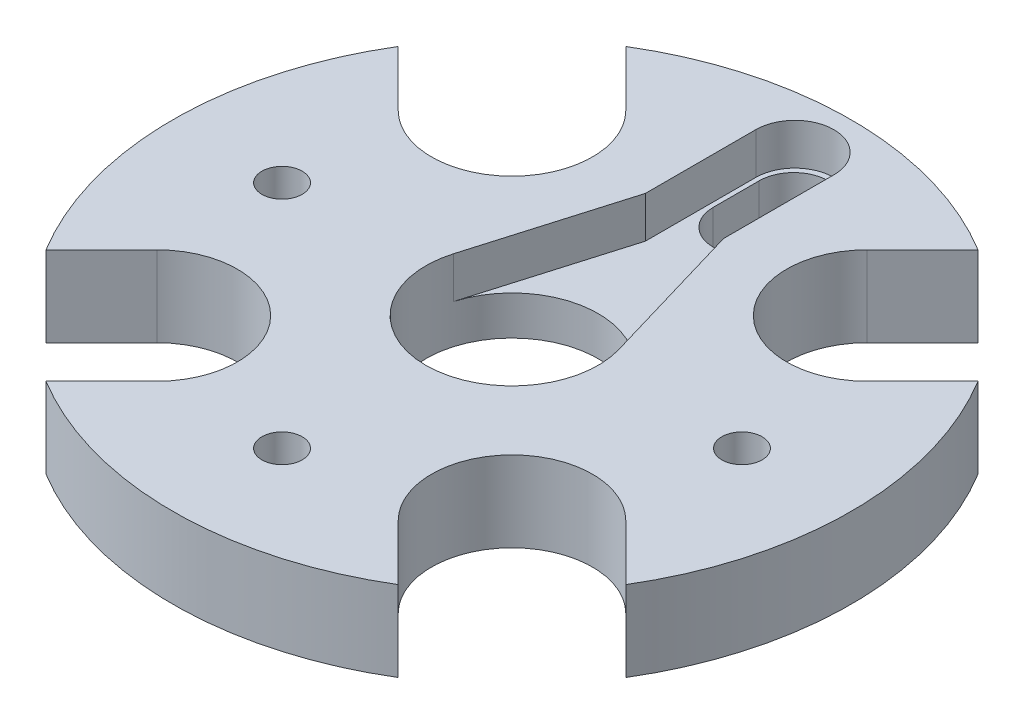
ISO-10303-21;
HEADER;
FILE_DESCRIPTION(('STEP AP214'),'2;1');
FILE_NAME('part.step','',(''),(''),'','','');
FILE_SCHEMA(('AUTOMOTIVE_DESIGN { 1 0 10303 214 1 1 1 1 }'));
ENDSEC;
DATA;
#1=APPLICATION_CONTEXT('core data for automotive mechanical design processes');
#2=APPLICATION_PROTOCOL_DEFINITION('international standard','automotive_design',2000,#1);
#3=PRODUCT_CONTEXT('',#1,'mechanical');
#4=PRODUCT('Part','Part','',(#3));
#5=PRODUCT_RELATED_PRODUCT_CATEGORY('part','',(#4));
#6=PRODUCT_DEFINITION_FORMATION('','',#4);
#7=PRODUCT_DEFINITION_CONTEXT('part definition',#1,'design');
#8=PRODUCT_DEFINITION('design','',#6,#7);
#9=PRODUCT_DEFINITION_SHAPE('','',#8);
#10=(LENGTH_UNIT() NAMED_UNIT(*) SI_UNIT(.MILLI.,.METRE.));
#11=(NAMED_UNIT(*) PLANE_ANGLE_UNIT() SI_UNIT($,.RADIAN.));
#12=(NAMED_UNIT(*) SI_UNIT($,.STERADIAN.) SOLID_ANGLE_UNIT());
#13=UNCERTAINTY_MEASURE_WITH_UNIT(LENGTH_MEASURE(1.E-05),#10,'distance_accuracy_value','');
#14=(GEOMETRIC_REPRESENTATION_CONTEXT(3) GLOBAL_UNCERTAINTY_ASSIGNED_CONTEXT((#13)) GLOBAL_UNIT_ASSIGNED_CONTEXT((#10,
#11,#12)) REPRESENTATION_CONTEXT('',''));
#15=CARTESIAN_POINT('',(0.,0.,0.));
#16=DIRECTION('',(0.,0.,1.));
#17=DIRECTION('',(1.,0.,0.));
#18=AXIS2_PLACEMENT_3D('',#15,#16,#17);
#19=CARTESIAN_POINT('',(20.0000000000001,-2.9999999999999,1.1696199564426E-12));
#20=DIRECTION('',(0.,1.,0.));
#21=DIRECTION('',(0.,0.,1.));
#22=AXIS2_PLACEMENT_3D('',#19,#20,#21);
#23=CYLINDRICAL_SURFACE('',#22,1.74999999999924);
#24=CARTESIAN_POINT('',(20.0000000000001,7.,1.16767706614951E-12));
#25=DIRECTION('',(0.,1.,0.));
#26=DIRECTION('',(0.,0.,1.));
#27=AXIS2_PLACEMENT_3D('',#24,#25,#26);
#28=CIRCLE('',#27,1.74999999999924);
#29=CARTESIAN_POINT('',(20.0000000000001,7.,1.75000000000041));
#30=VERTEX_POINT('',#29);
#31=EDGE_CURVE('E255',#30,#30,#28,.T.);
#32=ORIENTED_EDGE('',*,*,#31,.T.);
#33=EDGE_LOOP('',(#32));
#34=FACE_BOUND('',#33,.T.);
#35=CARTESIAN_POINT('',(20.0000000000001,2.4,1.16857079568433E-12));
#36=DIRECTION('',(0.,-1.,0.));
#37=DIRECTION('',(0.,0.,-1.));
#38=AXIS2_PLACEMENT_3D('',#35,#36,#37);
#39=CIRCLE('',#38,1.74999999999924);
#40=CARTESIAN_POINT('',(20.0000000000001,2.4,-1.74999999999808));
#41=VERTEX_POINT('',#40);
#42=EDGE_CURVE('E38',#41,#41,#39,.F.);
#43=ORIENTED_EDGE('',*,*,#42,.F.);
#44=EDGE_LOOP('',(#43));
#45=FACE_BOUND('',#44,.T.);
#46=ADVANCED_FACE('F34',(#34,#45),#23,.F.);
#47=CARTESIAN_POINT('',(-20.0000000000004,-2.9999999999999,1.9817480989559E-13));
#48=DIRECTION('',(0.,1.,0.));
#49=DIRECTION('',(0.,0.,1.));
#50=AXIS2_PLACEMENT_3D('',#47,#48,#49);
#51=CYLINDRICAL_SURFACE('',#50,1.7499999999993);
#52=CARTESIAN_POINT('',(-20.0000000000004,7.,1.96231919602496E-13));
#53=DIRECTION('',(0.,1.,0.));
#54=DIRECTION('',(0.,0.,1.));
#55=AXIS2_PLACEMENT_3D('',#52,#53,#54);
#56=CIRCLE('',#55,1.7499999999993);
#57=CARTESIAN_POINT('',(-20.0000000000004,7.,1.74999999999949));
#58=VERTEX_POINT('',#57);
#59=EDGE_CURVE('E417',#58,#58,#56,.T.);
#60=ORIENTED_EDGE('',*,*,#59,.T.);
#61=EDGE_LOOP('',(#60));
#62=FACE_BOUND('',#61,.T.);
#63=CARTESIAN_POINT('',(-20.0000000000004,2.4,1.9712564913732E-13));
#64=DIRECTION('',(0.,-1.,0.));
#65=DIRECTION('',(0.,0.,-1.));
#66=AXIS2_PLACEMENT_3D('',#63,#64,#65);
#67=CIRCLE('',#66,1.7499999999993);
#68=CARTESIAN_POINT('',(-20.0000000000004,2.4,-1.7499999999991));
#69=VERTEX_POINT('',#68);
#70=EDGE_CURVE('E419',#69,#69,#67,.F.);
#71=ORIENTED_EDGE('',*,*,#70,.F.);
#72=EDGE_LOOP('',(#71));
#73=FACE_BOUND('',#72,.T.);
#74=ADVANCED_FACE('F470',(#62,#73),#51,.F.);
#75=CARTESIAN_POINT('',(-6.79456491070596E-13,-2.99999999999989,20.000000000001));
#76=DIRECTION('',(0.,1.,0.));
#77=DIRECTION('',(0.,0.,1.));
#78=AXIS2_PLACEMENT_3D('',#75,#76,#77);
#79=CYLINDRICAL_SURFACE('',#78,1.74999999999918);
#80=CARTESIAN_POINT('',(-6.79734046826752E-13,7.,20.000000000001));
#81=DIRECTION('',(0.,1.,0.));
#82=DIRECTION('',(0.,0.,1.));
#83=AXIS2_PLACEMENT_3D('',#80,#81,#82);
#84=CIRCLE('',#83,1.74999999999918);
#85=CARTESIAN_POINT('',(-6.79734046826752E-13,7.,21.7500000000002));
#86=VERTEX_POINT('',#85);
#87=EDGE_CURVE('E446',#86,#86,#84,.T.);
#88=ORIENTED_EDGE('',*,*,#87,.T.);
#89=EDGE_LOOP('',(#88));
#90=FACE_BOUND('',#89,.T.);
#91=CARTESIAN_POINT('',(-6.7960637117892E-13,2.4,20.000000000001));
#92=DIRECTION('',(0.,-1.,0.));
#93=DIRECTION('',(0.,0.,-1.));
#94=AXIS2_PLACEMENT_3D('',#91,#92,#93);
#95=CIRCLE('',#94,1.74999999999918);
#96=CARTESIAN_POINT('',(-6.7960637117892E-13,2.4,18.2500000000018));
#97=VERTEX_POINT('',#96);
#98=EDGE_CURVE('E415',#97,#97,#95,.F.);
#99=ORIENTED_EDGE('',*,*,#98,.F.);
#100=EDGE_LOOP('',(#99));
#101=FACE_BOUND('',#100,.T.);
#102=ADVANCED_FACE('F475',(#90,#101),#79,.F.);
#103=CARTESIAN_POINT('',(0.,7.,0.));
#104=DIRECTION('',(0.,-1.,0.));
#105=DIRECTION('',(0.,0.,-1.));
#106=AXIS2_PLACEMENT_3D('',#103,#104,#105);
#107=CYLINDRICAL_SURFACE('',#106,29.5);
#108=CARTESIAN_POINT('',(0.,7.,0.));
#109=DIRECTION('',(0.,1.,0.));
#110=DIRECTION('',(0.,0.,1.));
#111=AXIS2_PLACEMENT_3D('',#108,#109,#110);
#112=CIRCLE('',#111,29.5);
#113=CARTESIAN_POINT('',(25.2136315974653,7.,15.3141366608536));
#114=VERTEX_POINT('',#113);
#115=CARTESIAN_POINT('',(25.2136315974653,7.,-15.3141366608536));
#116=VERTEX_POINT('',#115);
#117=EDGE_CURVE('E372',#114,#116,#112,.T.);
#118=ORIENTED_EDGE('',*,*,#117,.F.);
#119=DIRECTION('',(0.,-1.,0.));
#120=VECTOR('',#119,1.);
#121=CARTESIAN_POINT('',(25.2136315974653,7.,15.3141366608536));
#122=LINE('',#121,#120);
#123=CARTESIAN_POINT('',(25.2136315974653,0.,15.3141366608536));
#124=VERTEX_POINT('',#123);
#125=EDGE_CURVE('E273',#114,#124,#122,.T.);
#126=ORIENTED_EDGE('',*,*,#125,.T.);
#127=CARTESIAN_POINT('',(0.,0.,0.));
#128=DIRECTION('',(0.,1.,0.));
#129=DIRECTION('',(0.,0.,1.));
#130=AXIS2_PLACEMENT_3D('',#127,#128,#129);
#131=CIRCLE('',#130,29.5);
#132=CARTESIAN_POINT('',(25.2136315974653,0.,-15.3141366608536));
#133=VERTEX_POINT('',#132);
#134=EDGE_CURVE('E356',#124,#133,#131,.T.);
#135=ORIENTED_EDGE('',*,*,#134,.T.);
#136=DIRECTION('',(0.,-1.,0.));
#137=VECTOR('',#136,1.);
#138=CARTESIAN_POINT('',(25.2136315974653,7.,-15.3141366608536));
#139=LINE('',#138,#137);
#140=EDGE_CURVE('E288',#133,#116,#139,.F.);
#141=ORIENTED_EDGE('',*,*,#140,.T.);
#142=EDGE_LOOP('',(#118,#126,#135,#141));
#143=FACE_BOUND('',#142,.T.);
#144=ADVANCED_FACE('F465',(#143),#107,.T.);
#145=CARTESIAN_POINT('',(-15.3141366608536,0.,25.2136315974653));
#146=VERTEX_POINT('',#145);
#147=CARTESIAN_POINT('',(15.3141366608536,0.,25.2136315974653));
#148=VERTEX_POINT('',#147);
#149=EDGE_CURVE('E588',#146,#148,#131,.T.);
#150=ORIENTED_EDGE('',*,*,#149,.T.);
#151=DIRECTION('',(0.,-1.,0.));
#152=VECTOR('',#151,1.);
#153=CARTESIAN_POINT('',(15.3141366608536,7.,25.2136315974653));
#154=LINE('',#153,#152);
#155=CARTESIAN_POINT('',(15.3141366608536,7.,25.2136315974653));
#156=VERTEX_POINT('',#155);
#157=EDGE_CURVE('E51',#148,#156,#154,.F.);
#158=ORIENTED_EDGE('',*,*,#157,.T.);
#159=CARTESIAN_POINT('',(-15.3141366608536,7.,25.2136315974653));
#160=VERTEX_POINT('',#159);
#161=EDGE_CURVE('E232',#160,#156,#112,.T.);
#162=ORIENTED_EDGE('',*,*,#161,.F.);
#163=DIRECTION('',(0.,-1.,0.));
#164=VECTOR('',#163,1.);
#165=CARTESIAN_POINT('',(-15.3141366608536,7.,25.2136315974653));
#166=LINE('',#165,#164);
#167=EDGE_CURVE('E269',#160,#146,#166,.T.);
#168=ORIENTED_EDGE('',*,*,#167,.T.);
#169=EDGE_LOOP('',(#150,#158,#162,#168));
#170=FACE_BOUND('',#169,.T.);
#171=ADVANCED_FACE('F608',(#170),#107,.T.);
#172=CARTESIAN_POINT('',(-25.2136315974653,0.,-15.3141366608536));
#173=VERTEX_POINT('',#172);
#174=CARTESIAN_POINT('',(-25.2136315974653,0.,15.3141366608536));
#175=VERTEX_POINT('',#174);
#176=EDGE_CURVE('E376',#173,#175,#131,.T.);
#177=ORIENTED_EDGE('',*,*,#176,.T.);
#178=DIRECTION('',(0.,-1.,0.));
#179=VECTOR('',#178,1.);
#180=CARTESIAN_POINT('',(-25.2136315974653,7.,15.3141366608536));
#181=LINE('',#180,#179);
#182=CARTESIAN_POINT('',(-25.2136315974653,7.,15.3141366608536));
#183=VERTEX_POINT('',#182);
#184=EDGE_CURVE('E59',#175,#183,#181,.F.);
#185=ORIENTED_EDGE('',*,*,#184,.T.);
#186=CARTESIAN_POINT('',(-25.2136315974653,7.,-15.3141366608536));
#187=VERTEX_POINT('',#186);
#188=EDGE_CURVE('E371',#187,#183,#112,.T.);
#189=ORIENTED_EDGE('',*,*,#188,.F.);
#190=DIRECTION('',(0.,-1.,0.));
#191=VECTOR('',#190,1.);
#192=CARTESIAN_POINT('',(-25.2136315974653,7.,-15.3141366608536));
#193=LINE('',#192,#191);
#194=EDGE_CURVE('E265',#187,#173,#193,.T.);
#195=ORIENTED_EDGE('',*,*,#194,.T.);
#196=EDGE_LOOP('',(#177,#185,#189,#195));
#197=FACE_BOUND('',#196,.T.);
#198=ADVANCED_FACE('F463',(#197),#107,.T.);
#199=CARTESIAN_POINT('',(15.3141366608536,0.,-25.2136315974653));
#200=VERTEX_POINT('',#199);
#201=CARTESIAN_POINT('',(-15.3141366608536,0.,-25.2136315974653));
#202=VERTEX_POINT('',#201);
#203=EDGE_CURVE('E373',#200,#202,#131,.T.);
#204=ORIENTED_EDGE('',*,*,#203,.T.);
#205=DIRECTION('',(0.,-1.,0.));
#206=VECTOR('',#205,1.);
#207=CARTESIAN_POINT('',(-15.3141366608536,7.,-25.2136315974653));
#208=LINE('',#207,#206);
#209=CARTESIAN_POINT('',(-15.3141366608536,7.,-25.2136315974653));
#210=VERTEX_POINT('',#209);
#211=EDGE_CURVE('E237',#202,#210,#208,.F.);
#212=ORIENTED_EDGE('',*,*,#211,.T.);
#213=CARTESIAN_POINT('',(15.3141366608536,7.,-25.2136315974653));
#214=VERTEX_POINT('',#213);
#215=EDGE_CURVE('E367',#214,#210,#112,.T.);
#216=ORIENTED_EDGE('',*,*,#215,.F.);
#217=DIRECTION('',(0.,-1.,0.));
#218=VECTOR('',#217,1.);
#219=CARTESIAN_POINT('',(15.3141366608536,7.,-25.2136315974653));
#220=LINE('',#219,#218);
#221=EDGE_CURVE('E292',#214,#200,#220,.T.);
#222=ORIENTED_EDGE('',*,*,#221,.T.);
#223=EDGE_LOOP('',(#204,#212,#216,#222));
#224=FACE_BOUND('',#223,.T.);
#225=ADVANCED_FACE('F36',(#224),#107,.T.);
#226=CARTESIAN_POINT('',(0.,7.,0.));
#227=DIRECTION('',(0.,1.,0.));
#228=DIRECTION('',(0.,0.,1.));
#229=AXIS2_PLACEMENT_3D('',#226,#227,#228);
#230=PLANE('',#229);
#231=ORIENTED_EDGE('',*,*,#87,.F.);
#232=EDGE_LOOP('',(#231));
#233=FACE_BOUND('',#232,.T.);
#234=ORIENTED_EDGE('',*,*,#59,.F.);
#235=EDGE_LOOP('',(#234));
#236=FACE_BOUND('',#235,.T.);
#237=ORIENTED_EDGE('',*,*,#31,.F.);
#238=EDGE_LOOP('',(#237));
#239=FACE_BOUND('',#238,.T.);
#240=DIRECTION('',(-0.707106781186547,0.,-0.707106781186547));
#241=VECTOR('',#240,1.);
#242=CARTESIAN_POINT('',(20.39295956942,7.,10.4934646328083));
#243=LINE('',#242,#241);
#244=CARTESIAN_POINT('',(20.39295956942,7.,10.4934646328083));
#245=VERTEX_POINT('',#244);
#246=EDGE_CURVE('E216',#114,#245,#243,.T.);
#247=ORIENTED_EDGE('',*,*,#246,.F.);
#248=ORIENTED_EDGE('',*,*,#117,.T.);
#249=DIRECTION('',(0.707106781186548,0.,-0.707106781186547));
#250=VECTOR('',#249,1.);
#251=CARTESIAN_POINT('',(20.39295956942,7.,-10.4934646328084));
#252=LINE('',#251,#250);
#253=CARTESIAN_POINT('',(20.39295956942,7.,-10.4934646328084));
#254=VERTEX_POINT('',#253);
#255=EDGE_CURVE('E279',#254,#116,#252,.T.);
#256=ORIENTED_EDGE('',*,*,#255,.F.);
#257=CARTESIAN_POINT('',(15.4432121011142,7.,-15.4432121011142));
#258=DIRECTION('',(0.,1.,0.));
#259=DIRECTION('',(0.,0.,1.));
#260=AXIS2_PLACEMENT_3D('',#257,#258,#259);
#261=CIRCLE('',#260,7.);
#262=CARTESIAN_POINT('',(10.4934646328083,7.,-20.39295956942));
#263=VERTEX_POINT('',#262);
#264=EDGE_CURVE('E276',#263,#254,#261,.T.);
#265=ORIENTED_EDGE('',*,*,#264,.F.);
#266=DIRECTION('',(-0.707106781186547,0.,0.707106781186547));
#267=VECTOR('',#266,1.);
#268=CARTESIAN_POINT('',(10.4934646328083,7.,-20.39295956942));
#269=LINE('',#268,#267);
#270=EDGE_CURVE('E282',#214,#263,#269,.T.);
#271=ORIENTED_EDGE('',*,*,#270,.F.);
#272=ORIENTED_EDGE('',*,*,#215,.T.);
#273=DIRECTION('',(-0.707106781186548,0.,-0.707106781186547));
#274=VECTOR('',#273,1.);
#275=CARTESIAN_POINT('',(-10.4934646328084,7.,-20.39295956942));
#276=LINE('',#275,#274);
#277=CARTESIAN_POINT('',(-10.4934646328084,7.,-20.39295956942));
#278=VERTEX_POINT('',#277);
#279=EDGE_CURVE('E254',#278,#210,#276,.T.);
#280=ORIENTED_EDGE('',*,*,#279,.F.);
#281=CARTESIAN_POINT('',(-15.4432121011142,7.,-15.4432121011142));
#282=DIRECTION('',(0.,1.,0.));
#283=DIRECTION('',(0.,0.,1.));
#284=AXIS2_PLACEMENT_3D('',#281,#282,#283);
#285=CIRCLE('',#284,7.);
#286=CARTESIAN_POINT('',(-20.39295956942,7.,-10.4934646328083));
#287=VERTEX_POINT('',#286);
#288=EDGE_CURVE('E251',#287,#278,#285,.T.);
#289=ORIENTED_EDGE('',*,*,#288,.F.);
#290=DIRECTION('',(0.707106781186548,0.,0.707106781186547));
#291=VECTOR('',#290,1.);
#292=CARTESIAN_POINT('',(-20.39295956942,7.,-10.4934646328083));
#293=LINE('',#292,#291);
#294=EDGE_CURVE('E257',#187,#287,#293,.T.);
#295=ORIENTED_EDGE('',*,*,#294,.F.);
#296=ORIENTED_EDGE('',*,*,#188,.T.);
#297=DIRECTION('',(-0.707106781186548,0.,0.707106781186548));
#298=VECTOR('',#297,1.);
#299=CARTESIAN_POINT('',(-20.39295956942,7.,10.4934646328084));
#300=LINE('',#299,#298);
#301=CARTESIAN_POINT('',(-20.39295956942,7.,10.4934646328084));
#302=VERTEX_POINT('',#301);
#303=EDGE_CURVE('E242',#302,#183,#300,.T.);
#304=ORIENTED_EDGE('',*,*,#303,.F.);
#305=CARTESIAN_POINT('',(-15.4432121011142,7.,15.4432121011142));
#306=DIRECTION('',(0.,1.,0.));
#307=DIRECTION('',(0.,0.,1.));
#308=AXIS2_PLACEMENT_3D('',#305,#306,#307);
#309=CIRCLE('',#308,7.);
#310=CARTESIAN_POINT('',(-10.4934646328083,7.,20.39295956942));
#311=VERTEX_POINT('',#310);
#312=EDGE_CURVE('E239',#311,#302,#309,.T.);
#313=ORIENTED_EDGE('',*,*,#312,.F.);
#314=DIRECTION('',(0.707106781186547,0.,-0.707106781186547));
#315=VECTOR('',#314,1.);
#316=CARTESIAN_POINT('',(-10.4934646328083,7.,20.39295956942));
#317=LINE('',#316,#315);
#318=EDGE_CURVE('E245',#160,#311,#317,.T.);
#319=ORIENTED_EDGE('',*,*,#318,.F.);
#320=ORIENTED_EDGE('',*,*,#161,.T.);
#321=DIRECTION('',(0.707106781186548,0.,0.707106781186548));
#322=VECTOR('',#321,1.);
#323=CARTESIAN_POINT('',(10.4934646328084,7.,20.39295956942));
#324=LINE('',#323,#322);
#325=CARTESIAN_POINT('',(10.4934646328084,7.,20.39295956942));
#326=VERTEX_POINT('',#325);
#327=EDGE_CURVE('E211',#326,#156,#324,.T.);
#328=ORIENTED_EDGE('',*,*,#327,.F.);
#329=CARTESIAN_POINT('',(15.4432121011142,7.,15.4432121011142));
#330=DIRECTION('',(0.,1.,0.));
#331=DIRECTION('',(0.,0.,1.));
#332=AXIS2_PLACEMENT_3D('',#329,#330,#331);
#333=CIRCLE('',#332,7.);
#334=EDGE_CURVE('E219',#245,#326,#333,.T.);
#335=ORIENTED_EDGE('',*,*,#334,.F.);
#336=EDGE_LOOP('',(#247,#248,#256,#265,#271,#272,#280,#289,#295,#296,#304,#313,#319,#320,#328,#335));
#337=FACE_BOUND('',#336,.T.);
#338=CARTESIAN_POINT('',(0.,7.,-24.6));
#339=DIRECTION('',(0.,1.,0.));
#340=DIRECTION('',(0.,0.,1.));
#341=AXIS2_PLACEMENT_3D('',#338,#339,#340);
#342=CIRCLE('',#341,3.4);
#343=CARTESIAN_POINT('',(3.4,7.,-24.6));
#344=VERTEX_POINT('',#343);
#345=CARTESIAN_POINT('',(-3.4,7.,-24.6));
#346=VERTEX_POINT('',#345);
#347=EDGE_CURVE('E321',#344,#346,#342,.T.);
#348=ORIENTED_EDGE('',*,*,#347,.F.);
#349=DIRECTION('',(0.,0.,-1.));
#350=VECTOR('',#349,1.);
#351=CARTESIAN_POINT('',(3.4,7.,-24.6));
#352=LINE('',#351,#350);
#353=CARTESIAN_POINT('',(3.4,7.,-15.));
#354=VERTEX_POINT('',#353);
#355=EDGE_CURVE('E326',#354,#344,#352,.T.);
#356=ORIENTED_EDGE('',*,*,#355,.F.);
#357=DIRECTION('',(-0.282570806121011,0.,-0.959246443583776));
#358=VECTOR('',#357,1.);
#359=CARTESIAN_POINT('',(3.4,7.,-15.));
#360=LINE('',#359,#358);
#361=CARTESIAN_POINT('',(7.19434832687832,7.,-2.11928104590758));
#362=VERTEX_POINT('',#361);
#363=EDGE_CURVE('E349',#362,#354,#360,.T.);
#364=ORIENTED_EDGE('',*,*,#363,.F.);
#365=CARTESIAN_POINT('',(0.,7.,0.));
#366=DIRECTION('',(0.,1.,0.));
#367=DIRECTION('',(0.,0.,1.));
#368=AXIS2_PLACEMENT_3D('',#365,#366,#367);
#369=CIRCLE('',#368,7.5);
#370=CARTESIAN_POINT('',(-7.19434832687832,7.,-2.11928104590758));
#371=VERTEX_POINT('',#370);
#372=EDGE_CURVE('E346',#371,#362,#369,.T.);
#373=ORIENTED_EDGE('',*,*,#372,.F.);
#374=DIRECTION('',(-0.282570806121011,0.,0.959246443583776));
#375=VECTOR('',#374,1.);
#376=CARTESIAN_POINT('',(-3.4,7.,-15.));
#377=LINE('',#376,#375);
#378=CARTESIAN_POINT('',(-3.4,7.,-15.));
#379=VERTEX_POINT('',#378);
#380=EDGE_CURVE('E343',#379,#371,#377,.T.);
#381=ORIENTED_EDGE('',*,*,#380,.F.);
#382=DIRECTION('',(0.,0.,1.));
#383=VECTOR('',#382,1.);
#384=CARTESIAN_POINT('',(-3.4,7.,-24.6));
#385=LINE('',#384,#383);
#386=EDGE_CURVE('E340',#346,#379,#385,.T.);
#387=ORIENTED_EDGE('',*,*,#386,.F.);
#388=EDGE_LOOP('',(#348,#356,#364,#373,#381,#387));
#389=FACE_BOUND('',#388,.T.);
#390=ADVANCED_FACE('F228',(#233,#236,#239,#337,#389),#230,.T.);
#391=CARTESIAN_POINT('',(0.,0.,0.));
#392=DIRECTION('',(0.,1.,0.));
#393=DIRECTION('',(0.,0.,1.));
#394=AXIS2_PLACEMENT_3D('',#391,#392,#393);
#395=PLANE('',#394);
#396=CARTESIAN_POINT('',(19.9999999999669,0.,-3.87346404950861E-11));
#397=DIRECTION('',(0.,-1.,0.));
#398=DIRECTION('',(0.,0.,-1.));
#399=AXIS2_PLACEMENT_3D('',#396,#397,#398);
#400=CIRCLE('',#399,3.75000000004286);
#401=CARTESIAN_POINT('',(19.9999999999669,0.,-3.75000000008159));
#402=VERTEX_POINT('',#401);
#403=EDGE_CURVE('E427',#402,#402,#400,.T.);
#404=ORIENTED_EDGE('',*,*,#403,.F.);
#405=EDGE_LOOP('',(#404));
#406=FACE_BOUND('',#405,.T.);
#407=CARTESIAN_POINT('',(-19.9999999999654,0.,4.02317068548541E-11));
#408=DIRECTION('',(0.,-1.,0.));
#409=DIRECTION('',(0.,0.,-1.));
#410=AXIS2_PLACEMENT_3D('',#407,#408,#409);
#411=CIRCLE('',#410,3.74999999995528);
#412=CARTESIAN_POINT('',(-19.9999999999654,0.,-3.74999999991505));
#413=VERTEX_POINT('',#412);
#414=EDGE_CURVE('E437',#413,#413,#411,.T.);
#415=ORIENTED_EDGE('',*,*,#414,.F.);
#416=EDGE_LOOP('',(#415));
#417=FACE_BOUND('',#416,.T.);
#418=CARTESIAN_POINT('',(4.02785443887055E-11,0.,19.9999999999668));
#419=DIRECTION('',(0.,-1.,0.));
#420=DIRECTION('',(0.,0.,-1.));
#421=AXIS2_PLACEMENT_3D('',#418,#419,#420);
#422=CIRCLE('',#421,3.7499999999718);
#423=CARTESIAN_POINT('',(4.02785443887055E-11,0.,16.249999999995));
#424=VERTEX_POINT('',#423);
#425=EDGE_CURVE('E425',#424,#424,#422,.T.);
#426=ORIENTED_EDGE('',*,*,#425,.F.);
#427=EDGE_LOOP('',(#426));
#428=FACE_BOUND('',#427,.T.);
#429=DIRECTION('',(0.,0.,-1.));
#430=VECTOR('',#429,1.);
#431=CARTESIAN_POINT('',(3.,0.,0.));
#432=LINE('',#431,#430);
#433=CARTESIAN_POINT('',(3.,0.,-20.5));
#434=VERTEX_POINT('',#433);
#435=CARTESIAN_POINT('',(3.,0.,-24.5));
#436=VERTEX_POINT('',#435);
#437=EDGE_CURVE('E312',#434,#436,#432,.T.);
#438=ORIENTED_EDGE('',*,*,#437,.T.);
#439=CARTESIAN_POINT('',(0.,0.,-24.5));
#440=DIRECTION('',(0.,1.,0.));
#441=DIRECTION('',(0.,0.,1.));
#442=AXIS2_PLACEMENT_3D('',#439,#440,#441);
#443=CIRCLE('',#442,3.);
#444=CARTESIAN_POINT('',(-3.,0.,-24.5));
#445=VERTEX_POINT('',#444);
#446=EDGE_CURVE('E315',#436,#445,#443,.T.);
#447=ORIENTED_EDGE('',*,*,#446,.T.);
#448=DIRECTION('',(0.,0.,1.));
#449=VECTOR('',#448,1.);
#450=CARTESIAN_POINT('',(-3.,0.,0.));
#451=LINE('',#450,#449);
#452=CARTESIAN_POINT('',(-3.,0.,-20.5));
#453=VERTEX_POINT('',#452);
#454=EDGE_CURVE('E299',#445,#453,#451,.T.);
#455=ORIENTED_EDGE('',*,*,#454,.T.);
#456=CARTESIAN_POINT('',(0.,0.,-20.5));
#457=DIRECTION('',(0.,1.,0.));
#458=DIRECTION('',(0.,0.,1.));
#459=AXIS2_PLACEMENT_3D('',#456,#457,#458);
#460=CIRCLE('',#459,3.);
#461=EDGE_CURVE('E309',#453,#434,#460,.T.);
#462=ORIENTED_EDGE('',*,*,#461,.T.);
#463=EDGE_LOOP('',(#438,#447,#455,#462));
#464=FACE_BOUND('',#463,.T.);
#465=CARTESIAN_POINT('',(0.,0.,0.));
#466=DIRECTION('',(0.,1.,0.));
#467=DIRECTION('',(0.,0.,1.));
#468=AXIS2_PLACEMENT_3D('',#465,#466,#467);
#469=CIRCLE('',#468,7.5);
#470=CARTESIAN_POINT('',(0.,0.,7.5));
#471=VERTEX_POINT('',#470);
#472=EDGE_CURVE('E318',#471,#471,#469,.T.);
#473=ORIENTED_EDGE('',*,*,#472,.T.);
#474=EDGE_LOOP('',(#473));
#475=FACE_BOUND('',#474,.T.);
#476=ORIENTED_EDGE('',*,*,#134,.F.);
#477=DIRECTION('',(-0.707106781186548,0.,-0.707106781186547));
#478=VECTOR('',#477,1.);
#479=CARTESIAN_POINT('',(4.94974746830586,0.,-4.94974746830586));
#480=LINE('',#479,#478);
#481=CARTESIAN_POINT('',(20.39295956942,0.,10.4934646328083));
#482=VERTEX_POINT('',#481);
#483=EDGE_CURVE('E11',#124,#482,#480,.T.);
#484=ORIENTED_EDGE('',*,*,#483,.T.);
#485=CARTESIAN_POINT('',(15.4432121011142,0.,15.4432121011142));
#486=DIRECTION('',(0.,1.,0.));
#487=DIRECTION('',(0.,0.,1.));
#488=AXIS2_PLACEMENT_3D('',#485,#486,#487);
#489=CIRCLE('',#488,7.);
#490=CARTESIAN_POINT('',(10.4934646328084,0.,20.39295956942));
#491=VERTEX_POINT('',#490);
#492=EDGE_CURVE('E43',#482,#491,#489,.T.);
#493=ORIENTED_EDGE('',*,*,#492,.T.);
#494=DIRECTION('',(0.707106781186548,0.,0.707106781186548));
#495=VECTOR('',#494,1.);
#496=CARTESIAN_POINT('',(-4.9497474683058,0.,4.9497474683058));
#497=LINE('',#496,#495);
#498=EDGE_CURVE('E212',#491,#148,#497,.T.);
#499=ORIENTED_EDGE('',*,*,#498,.T.);
#500=ORIENTED_EDGE('',*,*,#149,.F.);
#501=DIRECTION('',(0.707106781186547,0.,-0.707106781186548));
#502=VECTOR('',#501,1.);
#503=CARTESIAN_POINT('',(4.94974746830586,0.,4.94974746830586));
#504=LINE('',#503,#502);
#505=CARTESIAN_POINT('',(-10.4934646328083,0.,20.39295956942));
#506=VERTEX_POINT('',#505);
#507=EDGE_CURVE('E410',#146,#506,#504,.T.);
#508=ORIENTED_EDGE('',*,*,#507,.T.);
#509=CARTESIAN_POINT('',(-15.4432121011142,0.,15.4432121011142));
#510=DIRECTION('',(0.,1.,0.));
#511=DIRECTION('',(0.,0.,1.));
#512=AXIS2_PLACEMENT_3D('',#509,#510,#511);
#513=CIRCLE('',#512,7.);
#514=CARTESIAN_POINT('',(-20.39295956942,0.,10.4934646328084));
#515=VERTEX_POINT('',#514);
#516=EDGE_CURVE('E407',#506,#515,#513,.T.);
#517=ORIENTED_EDGE('',*,*,#516,.T.);
#518=DIRECTION('',(-0.707106781186548,0.,0.707106781186548));
#519=VECTOR('',#518,1.);
#520=CARTESIAN_POINT('',(-4.9497474683058,0.,-4.9497474683058));
#521=LINE('',#520,#519);
#522=EDGE_CURVE('E405',#515,#175,#521,.T.);
#523=ORIENTED_EDGE('',*,*,#522,.T.);
#524=ORIENTED_EDGE('',*,*,#176,.F.);
#525=DIRECTION('',(0.707106781186548,0.,0.707106781186547));
#526=VECTOR('',#525,1.);
#527=CARTESIAN_POINT('',(-4.94974746830585,0.,4.94974746830586));
#528=LINE('',#527,#526);
#529=CARTESIAN_POINT('',(-20.39295956942,0.,-10.4934646328083));
#530=VERTEX_POINT('',#529);
#531=EDGE_CURVE('E402',#173,#530,#528,.T.);
#532=ORIENTED_EDGE('',*,*,#531,.T.);
#533=CARTESIAN_POINT('',(-15.4432121011142,0.,-15.4432121011142));
#534=DIRECTION('',(0.,1.,0.));
#535=DIRECTION('',(0.,0.,1.));
#536=AXIS2_PLACEMENT_3D('',#533,#534,#535);
#537=CIRCLE('',#536,7.);
#538=CARTESIAN_POINT('',(-10.4934646328084,0.,-20.39295956942));
#539=VERTEX_POINT('',#538);
#540=EDGE_CURVE('E399',#530,#539,#537,.T.);
#541=ORIENTED_EDGE('',*,*,#540,.T.);
#542=DIRECTION('',(-0.707106781186548,0.,-0.707106781186547));
#543=VECTOR('',#542,1.);
#544=CARTESIAN_POINT('',(4.9497474683058,0.,-4.9497474683058));
#545=LINE('',#544,#543);
#546=EDGE_CURVE('E396',#539,#202,#545,.T.);
#547=ORIENTED_EDGE('',*,*,#546,.T.);
#548=ORIENTED_EDGE('',*,*,#203,.F.);
#549=DIRECTION('',(-0.707106781186548,0.,0.707106781186548));
#550=VECTOR('',#549,1.);
#551=CARTESIAN_POINT('',(-4.94974746830586,0.,-4.94974746830586));
#552=LINE('',#551,#550);
#553=CARTESIAN_POINT('',(10.4934646328083,0.,-20.39295956942));
#554=VERTEX_POINT('',#553);
#555=EDGE_CURVE('E393',#200,#554,#552,.T.);
#556=ORIENTED_EDGE('',*,*,#555,.T.);
#557=CARTESIAN_POINT('',(15.4432121011142,0.,-15.4432121011142));
#558=DIRECTION('',(0.,1.,0.));
#559=DIRECTION('',(0.,0.,1.));
#560=AXIS2_PLACEMENT_3D('',#557,#558,#559);
#561=CIRCLE('',#560,7.);
#562=CARTESIAN_POINT('',(20.39295956942,0.,-10.4934646328084));
#563=VERTEX_POINT('',#562);
#564=EDGE_CURVE('E390',#554,#563,#561,.T.);
#565=ORIENTED_EDGE('',*,*,#564,.T.);
#566=DIRECTION('',(0.707106781186548,0.,-0.707106781186547));
#567=VECTOR('',#566,1.);
#568=CARTESIAN_POINT('',(4.94974746830581,0.,4.94974746830581));
#569=LINE('',#568,#567);
#570=EDGE_CURVE('E387',#563,#133,#569,.T.);
#571=ORIENTED_EDGE('',*,*,#570,.T.);
#572=EDGE_LOOP('',(#476,#484,#493,#499,#500,#508,#517,#523,#524,#532,#541,#547,#548,#556,#565,#571));
#573=FACE_BOUND('',#572,.T.);
#574=ADVANCED_FACE('F454',(#406,#417,#428,#464,#475,#573),#395,.F.);
#575=CARTESIAN_POINT('',(0.,3.4,-24.6));
#576=DIRECTION('',(0.,1.,0.));
#577=DIRECTION('',(0.,0.,1.));
#578=AXIS2_PLACEMENT_3D('',#575,#576,#577);
#579=CYLINDRICAL_SURFACE('',#578,3.4);
#580=ORIENTED_EDGE('',*,*,#347,.T.);
#581=DIRECTION('',(0.,1.,0.));
#582=VECTOR('',#581,1.);
#583=CARTESIAN_POINT('',(-3.4,3.4,-24.6));
#584=LINE('',#583,#582);
#585=CARTESIAN_POINT('',(-3.4,3.4,-24.6));
#586=VERTEX_POINT('',#585);
#587=EDGE_CURVE('E338',#586,#346,#584,.T.);
#588=ORIENTED_EDGE('',*,*,#587,.F.);
#589=CARTESIAN_POINT('',(0.,3.4,-24.6));
#590=DIRECTION('',(0.,1.,0.));
#591=DIRECTION('',(0.,0.,1.));
#592=AXIS2_PLACEMENT_3D('',#589,#590,#591);
#593=CIRCLE('',#592,3.4);
#594=CARTESIAN_POINT('',(3.4,3.4,-24.6));
#595=VERTEX_POINT('',#594);
#596=EDGE_CURVE('E322',#595,#586,#593,.T.);
#597=ORIENTED_EDGE('',*,*,#596,.F.);
#598=DIRECTION('',(0.,1.,0.));
#599=VECTOR('',#598,1.);
#600=CARTESIAN_POINT('',(3.4,3.4,-24.6));
#601=LINE('',#600,#599);
#602=EDGE_CURVE('E354',#595,#344,#601,.T.);
#603=ORIENTED_EDGE('',*,*,#602,.T.);
#604=EDGE_LOOP('',(#580,#588,#597,#603));
#605=FACE_BOUND('',#604,.T.);
#606=ADVANCED_FACE('F461',(#605),#579,.F.);
#607=CARTESIAN_POINT('',(3.4,3.4,-24.6));
#608=DIRECTION('',(1.,0.,0.));
#609=DIRECTION('',(0.,0.,-1.));
#610=AXIS2_PLACEMENT_3D('',#607,#608,#609);
#611=PLANE('',#610);
#612=ORIENTED_EDGE('',*,*,#355,.T.);
#613=ORIENTED_EDGE('',*,*,#602,.F.);
#614=DIRECTION('',(0.,0.,-1.));
#615=VECTOR('',#614,1.);
#616=CARTESIAN_POINT('',(3.4,3.4,-24.6));
#617=LINE('',#616,#615);
#618=CARTESIAN_POINT('',(3.4,3.4,-15.));
#619=VERTEX_POINT('',#618);
#620=EDGE_CURVE('E335',#619,#595,#617,.T.);
#621=ORIENTED_EDGE('',*,*,#620,.F.);
#622=DIRECTION('',(0.,1.,0.));
#623=VECTOR('',#622,1.);
#624=CARTESIAN_POINT('',(3.4,3.4,-15.));
#625=LINE('',#624,#623);
#626=EDGE_CURVE('E357',#619,#354,#625,.T.);
#627=ORIENTED_EDGE('',*,*,#626,.T.);
#628=EDGE_LOOP('',(#612,#613,#621,#627));
#629=FACE_BOUND('',#628,.T.);
#630=ADVANCED_FACE('F545',(#629),#611,.F.);
#631=CARTESIAN_POINT('',(3.4,3.4,-15.));
#632=DIRECTION('',(0.959246443583776,0.,-0.282570806121011));
#633=DIRECTION('',(-0.282570806121011,0.,-0.959246443583776));
#634=AXIS2_PLACEMENT_3D('',#631,#632,#633);
#635=PLANE('',#634);
#636=ORIENTED_EDGE('',*,*,#363,.T.);
#637=ORIENTED_EDGE('',*,*,#626,.F.);
#638=DIRECTION('',(-0.282570806121011,0.,-0.959246443583776));
#639=VECTOR('',#638,1.);
#640=CARTESIAN_POINT('',(3.4,3.4,-15.));
#641=LINE('',#640,#639);
#642=CARTESIAN_POINT('',(7.19434832687832,3.4,-2.11928104590758));
#643=VERTEX_POINT('',#642);
#644=EDGE_CURVE('E332',#643,#619,#641,.T.);
#645=ORIENTED_EDGE('',*,*,#644,.F.);
#646=DIRECTION('',(0.,1.,0.));
#647=VECTOR('',#646,1.);
#648=CARTESIAN_POINT('',(7.19434832687832,3.4,-2.11928104590758));
#649=LINE('',#648,#647);
#650=EDGE_CURVE('E359',#643,#362,#649,.T.);
#651=ORIENTED_EDGE('',*,*,#650,.T.);
#652=EDGE_LOOP('',(#636,#637,#645,#651));
#653=FACE_BOUND('',#652,.T.);
#654=ADVANCED_FACE('F548',(#653),#635,.F.);
#655=CARTESIAN_POINT('',(0.,3.4,0.));
#656=DIRECTION('',(0.,1.,0.));
#657=DIRECTION('',(0.,0.,1.));
#658=AXIS2_PLACEMENT_3D('',#655,#656,#657);
#659=CYLINDRICAL_SURFACE('',#658,7.5);
#660=ORIENTED_EDGE('',*,*,#372,.T.);
#661=ORIENTED_EDGE('',*,*,#650,.F.);
#662=CARTESIAN_POINT('',(0.,3.4,0.));
#663=DIRECTION('',(0.,1.,0.));
#664=DIRECTION('',(0.,0.,1.));
#665=AXIS2_PLACEMENT_3D('',#662,#663,#664);
#666=CIRCLE('',#665,7.5);
#667=CARTESIAN_POINT('',(-7.19434832687832,3.4,-2.11928104590758));
#668=VERTEX_POINT('',#667);
#669=EDGE_CURVE('E370',#643,#668,#666,.T.);
#670=ORIENTED_EDGE('',*,*,#669,.T.);
#671=DIRECTION('',(0.,1.,0.));
#672=VECTOR('',#671,1.);
#673=CARTESIAN_POINT('',(-7.19434832687832,3.4,-2.11928104590758));
#674=LINE('',#673,#672);
#675=EDGE_CURVE('E361',#668,#371,#674,.T.);
#676=ORIENTED_EDGE('',*,*,#675,.T.);
#677=EDGE_LOOP('',(#660,#661,#670,#676));
#678=FACE_BOUND('',#677,.T.);
#679=ORIENTED_EDGE('',*,*,#472,.F.);
#680=EDGE_LOOP('',(#679));
#681=FACE_BOUND('',#680,.T.);
#682=ADVANCED_FACE('F552',(#678,#681),#659,.F.);
#683=CARTESIAN_POINT('',(-3.4,3.4,-15.));
#684=DIRECTION('',(-0.959246443583776,0.,-0.282570806121011));
#685=DIRECTION('',(-0.282570806121011,0.,0.959246443583776));
#686=AXIS2_PLACEMENT_3D('',#683,#684,#685);
#687=PLANE('',#686);
#688=ORIENTED_EDGE('',*,*,#380,.T.);
#689=ORIENTED_EDGE('',*,*,#675,.F.);
#690=DIRECTION('',(-0.282570806121011,0.,0.959246443583776));
#691=VECTOR('',#690,1.);
#692=CARTESIAN_POINT('',(-3.4,3.4,-15.));
#693=LINE('',#692,#691);
#694=CARTESIAN_POINT('',(-3.4,3.4,-15.));
#695=VERTEX_POINT('',#694);
#696=EDGE_CURVE('E329',#695,#668,#693,.T.);
#697=ORIENTED_EDGE('',*,*,#696,.F.);
#698=DIRECTION('',(0.,1.,0.));
#699=VECTOR('',#698,1.);
#700=CARTESIAN_POINT('',(-3.4,3.4,-15.));
#701=LINE('',#700,#699);
#702=EDGE_CURVE('E363',#695,#379,#701,.T.);
#703=ORIENTED_EDGE('',*,*,#702,.T.);
#704=EDGE_LOOP('',(#688,#689,#697,#703));
#705=FACE_BOUND('',#704,.T.);
#706=ADVANCED_FACE('F556',(#705),#687,.F.);
#707=CARTESIAN_POINT('',(-3.4,3.4,-24.6));
#708=DIRECTION('',(-1.,0.,0.));
#709=DIRECTION('',(0.,0.,1.));
#710=AXIS2_PLACEMENT_3D('',#707,#708,#709);
#711=PLANE('',#710);
#712=ORIENTED_EDGE('',*,*,#386,.T.);
#713=ORIENTED_EDGE('',*,*,#702,.F.);
#714=DIRECTION('',(0.,0.,1.));
#715=VECTOR('',#714,1.);
#716=CARTESIAN_POINT('',(-3.4,3.4,-24.6));
#717=LINE('',#716,#715);
#718=EDGE_CURVE('E325',#586,#695,#717,.T.);
#719=ORIENTED_EDGE('',*,*,#718,.F.);
#720=ORIENTED_EDGE('',*,*,#587,.T.);
#721=EDGE_LOOP('',(#712,#713,#719,#720));
#722=FACE_BOUND('',#721,.T.);
#723=ADVANCED_FACE('F543',(#722),#711,.F.);
#724=CARTESIAN_POINT('',(0.,3.4,-24.6));
#725=DIRECTION('',(0.,1.,0.));
#726=DIRECTION('',(0.,0.,1.));
#727=AXIS2_PLACEMENT_3D('',#724,#725,#726);
#728=PLANE('',#727);
#729=CARTESIAN_POINT('',(0.,3.4,-24.5));
#730=DIRECTION('',(0.,1.,0.));
#731=DIRECTION('',(0.,0.,1.));
#732=AXIS2_PLACEMENT_3D('',#729,#730,#731);
#733=CIRCLE('',#732,3.);
#734=CARTESIAN_POINT('',(3.,3.4,-24.5));
#735=VERTEX_POINT('',#734);
#736=CARTESIAN_POINT('',(-3.,3.4,-24.5));
#737=VERTEX_POINT('',#736);
#738=EDGE_CURVE('E384',#735,#737,#733,.T.);
#739=ORIENTED_EDGE('',*,*,#738,.F.);
#740=DIRECTION('',(0.,0.,-1.));
#741=VECTOR('',#740,1.);
#742=CARTESIAN_POINT('',(3.,3.4,-24.6));
#743=LINE('',#742,#741);
#744=CARTESIAN_POINT('',(3.,3.4,-20.5));
#745=VERTEX_POINT('',#744);
#746=EDGE_CURVE('E382',#745,#735,#743,.T.);
#747=ORIENTED_EDGE('',*,*,#746,.F.);
#748=CARTESIAN_POINT('',(0.,3.4,-20.5));
#749=DIRECTION('',(0.,1.,0.));
#750=DIRECTION('',(0.,0.,1.));
#751=AXIS2_PLACEMENT_3D('',#748,#749,#750);
#752=CIRCLE('',#751,3.);
#753=CARTESIAN_POINT('',(-3.,3.4,-20.5));
#754=VERTEX_POINT('',#753);
#755=EDGE_CURVE('E380',#754,#745,#752,.T.);
#756=ORIENTED_EDGE('',*,*,#755,.F.);
#757=DIRECTION('',(0.,0.,1.));
#758=VECTOR('',#757,1.);
#759=CARTESIAN_POINT('',(-3.,3.4,-24.6));
#760=LINE('',#759,#758);
#761=EDGE_CURVE('E378',#737,#754,#760,.T.);
#762=ORIENTED_EDGE('',*,*,#761,.F.);
#763=EDGE_LOOP('',(#739,#747,#756,#762));
#764=FACE_BOUND('',#763,.T.);
#765=ORIENTED_EDGE('',*,*,#669,.F.);
#766=ORIENTED_EDGE('',*,*,#644,.T.);
#767=ORIENTED_EDGE('',*,*,#620,.T.);
#768=ORIENTED_EDGE('',*,*,#596,.T.);
#769=ORIENTED_EDGE('',*,*,#718,.T.);
#770=ORIENTED_EDGE('',*,*,#696,.T.);
#771=EDGE_LOOP('',(#765,#766,#767,#768,#769,#770));
#772=FACE_BOUND('',#771,.T.);
#773=ADVANCED_FACE('F539',(#764,#772),#728,.T.);
#774=CARTESIAN_POINT('',(0.,-4.8,-24.5));
#775=DIRECTION('',(0.,1.,0.));
#776=DIRECTION('',(0.,0.,1.));
#777=AXIS2_PLACEMENT_3D('',#774,#775,#776);
#778=CYLINDRICAL_SURFACE('',#777,3.);
#779=DIRECTION('',(0.,1.,0.));
#780=VECTOR('',#779,1.);
#781=CARTESIAN_POINT('',(3.,-4.8,-24.5));
#782=LINE('',#781,#780);
#783=EDGE_CURVE('E296',#436,#735,#782,.T.);
#784=ORIENTED_EDGE('',*,*,#783,.T.);
#785=ORIENTED_EDGE('',*,*,#738,.T.);
#786=DIRECTION('',(0.,1.,0.));
#787=VECTOR('',#786,1.);
#788=CARTESIAN_POINT('',(-3.,-4.8,-24.5));
#789=LINE('',#788,#787);
#790=EDGE_CURVE('E295',#445,#737,#789,.T.);
#791=ORIENTED_EDGE('',*,*,#790,.F.);
#792=ORIENTED_EDGE('',*,*,#446,.F.);
#793=EDGE_LOOP('',(#784,#785,#791,#792));
#794=FACE_BOUND('',#793,.T.);
#795=ADVANCED_FACE('F529',(#794),#778,.F.);
#796=CARTESIAN_POINT('',(3.,-4.8,-24.5));
#797=DIRECTION('',(1.,0.,0.));
#798=DIRECTION('',(0.,0.,-1.));
#799=AXIS2_PLACEMENT_3D('',#796,#797,#798);
#800=PLANE('',#799);
#801=DIRECTION('',(0.,1.,0.));
#802=VECTOR('',#801,1.);
#803=CARTESIAN_POINT('',(3.,-4.8,-20.5));
#804=LINE('',#803,#802);
#805=EDGE_CURVE('E300',#434,#745,#804,.T.);
#806=ORIENTED_EDGE('',*,*,#805,.T.);
#807=ORIENTED_EDGE('',*,*,#746,.T.);
#808=ORIENTED_EDGE('',*,*,#783,.F.);
#809=ORIENTED_EDGE('',*,*,#437,.F.);
#810=EDGE_LOOP('',(#806,#807,#808,#809));
#811=FACE_BOUND('',#810,.T.);
#812=ADVANCED_FACE('F525',(#811),#800,.F.);
#813=CARTESIAN_POINT('',(0.,-4.8,-20.5));
#814=DIRECTION('',(0.,1.,0.));
#815=DIRECTION('',(0.,0.,1.));
#816=AXIS2_PLACEMENT_3D('',#813,#814,#815);
#817=CYLINDRICAL_SURFACE('',#816,3.);
#818=DIRECTION('',(0.,1.,0.));
#819=VECTOR('',#818,1.);
#820=CARTESIAN_POINT('',(-3.,-4.8,-20.5));
#821=LINE('',#820,#819);
#822=EDGE_CURVE('E303',#453,#754,#821,.T.);
#823=ORIENTED_EDGE('',*,*,#822,.T.);
#824=ORIENTED_EDGE('',*,*,#755,.T.);
#825=ORIENTED_EDGE('',*,*,#805,.F.);
#826=ORIENTED_EDGE('',*,*,#461,.F.);
#827=EDGE_LOOP('',(#823,#824,#825,#826));
#828=FACE_BOUND('',#827,.T.);
#829=ADVANCED_FACE('F528',(#828),#817,.F.);
#830=CARTESIAN_POINT('',(-3.,-4.8,-24.5));
#831=DIRECTION('',(-1.,0.,0.));
#832=DIRECTION('',(0.,0.,1.));
#833=AXIS2_PLACEMENT_3D('',#830,#831,#832);
#834=PLANE('',#833);
#835=ORIENTED_EDGE('',*,*,#790,.T.);
#836=ORIENTED_EDGE('',*,*,#761,.T.);
#837=ORIENTED_EDGE('',*,*,#822,.F.);
#838=ORIENTED_EDGE('',*,*,#454,.F.);
#839=EDGE_LOOP('',(#835,#836,#837,#838));
#840=FACE_BOUND('',#839,.T.);
#841=ADVANCED_FACE('F523',(#840),#834,.F.);
#842=CARTESIAN_POINT('',(15.4432121011142,-8.8,-15.4432121011142));
#843=DIRECTION('',(0.,1.,0.));
#844=DIRECTION('',(0.,0.,1.));
#845=AXIS2_PLACEMENT_3D('',#842,#843,#844);
#846=CYLINDRICAL_SURFACE('',#845,7.);
#847=DIRECTION('',(0.,1.,0.));
#848=VECTOR('',#847,1.);
#849=CARTESIAN_POINT('',(10.4934646328083,-8.8,-20.39295956942));
#850=LINE('',#849,#848);
#851=EDGE_CURVE('E286',#554,#263,#850,.T.);
#852=ORIENTED_EDGE('',*,*,#851,.T.);
#853=ORIENTED_EDGE('',*,*,#264,.T.);
#854=DIRECTION('',(0.,1.,0.));
#855=VECTOR('',#854,1.);
#856=CARTESIAN_POINT('',(20.39295956942,-8.8,-10.4934646328084));
#857=LINE('',#856,#855);
#858=EDGE_CURVE('E285',#563,#254,#857,.T.);
#859=ORIENTED_EDGE('',*,*,#858,.F.);
#860=ORIENTED_EDGE('',*,*,#564,.F.);
#861=EDGE_LOOP('',(#852,#853,#859,#860));
#862=FACE_BOUND('',#861,.T.);
#863=ADVANCED_FACE('F516',(#862),#846,.F.);
#864=CARTESIAN_POINT('',(10.4934646328083,-8.8,-20.39295956942));
#865=DIRECTION('',(-0.707106781186548,0.,-0.707106781186548));
#866=DIRECTION('',(-0.707106781186548,0.,0.707106781186548));
#867=AXIS2_PLACEMENT_3D('',#864,#865,#866);
#868=PLANE('',#867);
#869=ORIENTED_EDGE('',*,*,#270,.T.);
#870=ORIENTED_EDGE('',*,*,#851,.F.);
#871=ORIENTED_EDGE('',*,*,#555,.F.);
#872=ORIENTED_EDGE('',*,*,#221,.F.);
#873=EDGE_LOOP('',(#869,#870,#871,#872));
#874=FACE_BOUND('',#873,.T.);
#875=ADVANCED_FACE('F513',(#874),#868,.F.);
#876=CARTESIAN_POINT('',(20.39295956942,-8.8,-10.4934646328084));
#877=DIRECTION('',(0.707106781186547,0.,0.707106781186548));
#878=DIRECTION('',(0.707106781186548,0.,-0.707106781186547));
#879=AXIS2_PLACEMENT_3D('',#876,#877,#878);
#880=PLANE('',#879);
#881=ORIENTED_EDGE('',*,*,#570,.F.);
#882=ORIENTED_EDGE('',*,*,#858,.T.);
#883=ORIENTED_EDGE('',*,*,#255,.T.);
#884=ORIENTED_EDGE('',*,*,#140,.F.);
#885=EDGE_LOOP('',(#881,#882,#883,#884));
#886=FACE_BOUND('',#885,.T.);
#887=ADVANCED_FACE('F511',(#886),#880,.F.);
#888=CARTESIAN_POINT('',(-15.4432121011142,-8.8,-15.4432121011142));
#889=DIRECTION('',(0.,1.,0.));
#890=DIRECTION('',(0.,0.,1.));
#891=AXIS2_PLACEMENT_3D('',#888,#889,#890);
#892=CYLINDRICAL_SURFACE('',#891,7.);
#893=DIRECTION('',(0.,1.,0.));
#894=VECTOR('',#893,1.);
#895=CARTESIAN_POINT('',(-20.39295956942,-8.8,-10.4934646328083));
#896=LINE('',#895,#894);
#897=EDGE_CURVE('E243',#530,#287,#896,.T.);
#898=ORIENTED_EDGE('',*,*,#897,.T.);
#899=ORIENTED_EDGE('',*,*,#288,.T.);
#900=DIRECTION('',(0.,1.,0.));
#901=VECTOR('',#900,1.);
#902=CARTESIAN_POINT('',(-10.4934646328084,-8.8,-20.39295956942));
#903=LINE('',#902,#901);
#904=EDGE_CURVE('E260',#539,#278,#903,.T.);
#905=ORIENTED_EDGE('',*,*,#904,.F.);
#906=ORIENTED_EDGE('',*,*,#540,.F.);
#907=EDGE_LOOP('',(#898,#899,#905,#906));
#908=FACE_BOUND('',#907,.T.);
#909=ADVANCED_FACE('F504',(#908),#892,.F.);
#910=CARTESIAN_POINT('',(-20.39295956942,-8.8,-10.4934646328083));
#911=DIRECTION('',(-0.707106781186547,0.,0.707106781186548));
#912=DIRECTION('',(0.707106781186548,0.,0.707106781186547));
#913=AXIS2_PLACEMENT_3D('',#910,#911,#912);
#914=PLANE('',#913);
#915=ORIENTED_EDGE('',*,*,#294,.T.);
#916=ORIENTED_EDGE('',*,*,#897,.F.);
#917=ORIENTED_EDGE('',*,*,#531,.F.);
#918=ORIENTED_EDGE('',*,*,#194,.F.);
#919=EDGE_LOOP('',(#915,#916,#917,#918));
#920=FACE_BOUND('',#919,.T.);
#921=ADVANCED_FACE('F501',(#920),#914,.F.);
#922=CARTESIAN_POINT('',(-10.4934646328084,-8.8,-20.39295956942));
#923=DIRECTION('',(0.707106781186547,0.,-0.707106781186548));
#924=DIRECTION('',(-0.707106781186548,0.,-0.707106781186547));
#925=AXIS2_PLACEMENT_3D('',#922,#923,#924);
#926=PLANE('',#925);
#927=ORIENTED_EDGE('',*,*,#546,.F.);
#928=ORIENTED_EDGE('',*,*,#904,.T.);
#929=ORIENTED_EDGE('',*,*,#279,.T.);
#930=ORIENTED_EDGE('',*,*,#211,.F.);
#931=EDGE_LOOP('',(#927,#928,#929,#930));
#932=FACE_BOUND('',#931,.T.);
#933=ADVANCED_FACE('F499',(#932),#926,.F.);
#934=CARTESIAN_POINT('',(-15.4432121011142,-8.8,15.4432121011142));
#935=DIRECTION('',(0.,1.,0.));
#936=DIRECTION('',(0.,0.,1.));
#937=AXIS2_PLACEMENT_3D('',#934,#935,#936);
#938=CYLINDRICAL_SURFACE('',#937,7.);
#939=DIRECTION('',(0.,1.,0.));
#940=VECTOR('',#939,1.);
#941=CARTESIAN_POINT('',(-10.4934646328083,-8.8,20.39295956942));
#942=LINE('',#941,#940);
#943=EDGE_CURVE('E225',#506,#311,#942,.T.);
#944=ORIENTED_EDGE('',*,*,#943,.T.);
#945=ORIENTED_EDGE('',*,*,#312,.T.);
#946=DIRECTION('',(0.,1.,0.));
#947=VECTOR('',#946,1.);
#948=CARTESIAN_POINT('',(-20.39295956942,-8.8,10.4934646328084));
#949=LINE('',#948,#947);
#950=EDGE_CURVE('E248',#515,#302,#949,.T.);
#951=ORIENTED_EDGE('',*,*,#950,.F.);
#952=ORIENTED_EDGE('',*,*,#516,.F.);
#953=EDGE_LOOP('',(#944,#945,#951,#952));
#954=FACE_BOUND('',#953,.T.);
#955=ADVANCED_FACE('F493',(#954),#938,.F.);
#956=CARTESIAN_POINT('',(-10.4934646328083,-8.8,20.39295956942));
#957=DIRECTION('',(0.707106781186548,0.,0.707106781186547));
#958=DIRECTION('',(0.707106781186547,0.,-0.707106781186548));
#959=AXIS2_PLACEMENT_3D('',#956,#957,#958);
#960=PLANE('',#959);
#961=ORIENTED_EDGE('',*,*,#318,.T.);
#962=ORIENTED_EDGE('',*,*,#943,.F.);
#963=ORIENTED_EDGE('',*,*,#507,.F.);
#964=ORIENTED_EDGE('',*,*,#167,.F.);
#965=EDGE_LOOP('',(#961,#962,#963,#964));
#966=FACE_BOUND('',#965,.T.);
#967=ADVANCED_FACE('F490',(#966),#960,.F.);
#968=CARTESIAN_POINT('',(-20.39295956942,-8.8,10.4934646328084));
#969=DIRECTION('',(-0.707106781186548,0.,-0.707106781186548));
#970=DIRECTION('',(-0.707106781186548,0.,0.707106781186548));
#971=AXIS2_PLACEMENT_3D('',#968,#969,#970);
#972=PLANE('',#971);
#973=ORIENTED_EDGE('',*,*,#522,.F.);
#974=ORIENTED_EDGE('',*,*,#950,.T.);
#975=ORIENTED_EDGE('',*,*,#303,.T.);
#976=ORIENTED_EDGE('',*,*,#184,.F.);
#977=EDGE_LOOP('',(#973,#974,#975,#976));
#978=FACE_BOUND('',#977,.T.);
#979=ADVANCED_FACE('F489',(#978),#972,.F.);
#980=CARTESIAN_POINT('',(15.4432121011142,-8.8,15.4432121011142));
#981=DIRECTION('',(0.,1.,0.));
#982=DIRECTION('',(0.,0.,1.));
#983=AXIS2_PLACEMENT_3D('',#980,#981,#982);
#984=CYLINDRICAL_SURFACE('',#983,7.);
#985=DIRECTION('',(0.,1.,0.));
#986=VECTOR('',#985,1.);
#987=CARTESIAN_POINT('',(20.39295956942,-8.8,10.4934646328083));
#988=LINE('',#987,#986);
#989=EDGE_CURVE('E215',#482,#245,#988,.T.);
#990=ORIENTED_EDGE('',*,*,#989,.T.);
#991=ORIENTED_EDGE('',*,*,#334,.T.);
#992=DIRECTION('',(0.,1.,0.));
#993=VECTOR('',#992,1.);
#994=CARTESIAN_POINT('',(10.4934646328084,-8.8,20.39295956942));
#995=LINE('',#994,#993);
#996=EDGE_CURVE('E207',#491,#326,#995,.T.);
#997=ORIENTED_EDGE('',*,*,#996,.F.);
#998=ORIENTED_EDGE('',*,*,#492,.F.);
#999=EDGE_LOOP('',(#990,#991,#997,#998));
#1000=FACE_BOUND('',#999,.T.);
#1001=ADVANCED_FACE('F220',(#1000),#984,.F.);
#1002=CARTESIAN_POINT('',(20.39295956942,-8.8,10.4934646328083));
#1003=DIRECTION('',(0.707106781186547,0.,-0.707106781186548));
#1004=DIRECTION('',(-0.707106781186548,0.,-0.707106781186547));
#1005=AXIS2_PLACEMENT_3D('',#1002,#1003,#1004);
#1006=PLANE('',#1005);
#1007=ORIENTED_EDGE('',*,*,#246,.T.);
#1008=ORIENTED_EDGE('',*,*,#989,.F.);
#1009=ORIENTED_EDGE('',*,*,#483,.F.);
#1010=ORIENTED_EDGE('',*,*,#125,.F.);
#1011=EDGE_LOOP('',(#1007,#1008,#1009,#1010));
#1012=FACE_BOUND('',#1011,.T.);
#1013=ADVANCED_FACE('F480',(#1012),#1006,.F.);
#1014=CARTESIAN_POINT('',(10.4934646328084,-8.8,20.39295956942));
#1015=DIRECTION('',(-0.707106781186548,0.,0.707106781186548));
#1016=DIRECTION('',(0.707106781186548,0.,0.707106781186548));
#1017=AXIS2_PLACEMENT_3D('',#1014,#1015,#1016);
#1018=PLANE('',#1017);
#1019=ORIENTED_EDGE('',*,*,#498,.F.);
#1020=ORIENTED_EDGE('',*,*,#996,.T.);
#1021=ORIENTED_EDGE('',*,*,#327,.T.);
#1022=ORIENTED_EDGE('',*,*,#157,.F.);
#1023=EDGE_LOOP('',(#1019,#1020,#1021,#1022));
#1024=FACE_BOUND('',#1023,.T.);
#1025=ADVANCED_FACE('F209',(#1024),#1018,.F.);
#1026=CARTESIAN_POINT('',(4.02785443887055E-11,2.4,19.9999999999668));
#1027=DIRECTION('',(0.,-1.,0.));
#1028=DIRECTION('',(0.,0.,-1.));
#1029=AXIS2_PLACEMENT_3D('',#1026,#1027,#1028);
#1030=PLANE('',#1029);
#1031=CARTESIAN_POINT('',(4.02785443887055E-11,2.4,19.9999999999668));
#1032=DIRECTION('',(0.,-1.,0.));
#1033=DIRECTION('',(0.,0.,-1.));
#1034=AXIS2_PLACEMENT_3D('',#1031,#1032,#1033);
#1035=CIRCLE('',#1034,3.7499999999718);
#1036=CARTESIAN_POINT('',(4.02785443887055E-11,2.4,16.249999999995));
#1037=VERTEX_POINT('',#1036);
#1038=EDGE_CURVE('E418',#1037,#1037,#1035,.T.);
#1039=ORIENTED_EDGE('',*,*,#1038,.T.);
#1040=EDGE_LOOP('',(#1039));
#1041=FACE_BOUND('',#1040,.T.);
#1042=ORIENTED_EDGE('',*,*,#98,.T.);
#1043=EDGE_LOOP('',(#1042));
#1044=FACE_BOUND('',#1043,.T.);
#1045=ADVANCED_FACE('F486',(#1041,#1044),#1030,.T.);
#1046=CARTESIAN_POINT('',(4.02785443887055E-11,2.4,19.9999999999668));
#1047=DIRECTION('',(0.,-1.,0.));
#1048=DIRECTION('',(0.,0.,-1.));
#1049=AXIS2_PLACEMENT_3D('',#1046,#1047,#1048);
#1050=CYLINDRICAL_SURFACE('',#1049,3.7499999999718);
#1051=ORIENTED_EDGE('',*,*,#1038,.F.);
#1052=EDGE_LOOP('',(#1051));
#1053=FACE_BOUND('',#1052,.T.);
#1054=ORIENTED_EDGE('',*,*,#425,.T.);
#1055=EDGE_LOOP('',(#1054));
#1056=FACE_BOUND('',#1055,.T.);
#1057=ADVANCED_FACE('F618',(#1053,#1056),#1050,.F.);
#1058=CARTESIAN_POINT('',(-19.9999999999654,2.4,4.02317068548541E-11));
#1059=DIRECTION('',(0.,-1.,0.));
#1060=DIRECTION('',(0.,0.,-1.));
#1061=AXIS2_PLACEMENT_3D('',#1058,#1059,#1060);
#1062=PLANE('',#1061);
#1063=CARTESIAN_POINT('',(-19.9999999999654,2.4,4.02317068548541E-11));
#1064=DIRECTION('',(0.,-1.,0.));
#1065=DIRECTION('',(0.,0.,-1.));
#1066=AXIS2_PLACEMENT_3D('',#1063,#1064,#1065);
#1067=CIRCLE('',#1066,3.74999999995528);
#1068=CARTESIAN_POINT('',(-19.9999999999654,2.4,-3.74999999991505));
#1069=VERTEX_POINT('',#1068);
#1070=EDGE_CURVE('E432',#1069,#1069,#1067,.T.);
#1071=ORIENTED_EDGE('',*,*,#1070,.T.);
#1072=EDGE_LOOP('',(#1071));
#1073=FACE_BOUND('',#1072,.T.);
#1074=ORIENTED_EDGE('',*,*,#70,.T.);
#1075=EDGE_LOOP('',(#1074));
#1076=FACE_BOUND('',#1075,.T.);
#1077=ADVANCED_FACE('F621',(#1073,#1076),#1062,.T.);
#1078=CARTESIAN_POINT('',(-19.9999999999654,2.4,4.02317068548541E-11));
#1079=DIRECTION('',(0.,-1.,0.));
#1080=DIRECTION('',(0.,0.,-1.));
#1081=AXIS2_PLACEMENT_3D('',#1078,#1079,#1080);
#1082=CYLINDRICAL_SURFACE('',#1081,3.74999999995528);
#1083=ORIENTED_EDGE('',*,*,#1070,.F.);
#1084=EDGE_LOOP('',(#1083));
#1085=FACE_BOUND('',#1084,.T.);
#1086=ORIENTED_EDGE('',*,*,#414,.T.);
#1087=EDGE_LOOP('',(#1086));
#1088=FACE_BOUND('',#1087,.T.);
#1089=ADVANCED_FACE('F626',(#1085,#1088),#1082,.F.);
#1090=CARTESIAN_POINT('',(19.9999999999669,2.4,-3.87346404950861E-11));
#1091=DIRECTION('',(0.,-1.,0.));
#1092=DIRECTION('',(0.,0.,-1.));
#1093=AXIS2_PLACEMENT_3D('',#1090,#1091,#1092);
#1094=PLANE('',#1093);
#1095=CARTESIAN_POINT('',(19.9999999999669,2.4,-3.87346404950861E-11));
#1096=DIRECTION('',(0.,-1.,0.));
#1097=DIRECTION('',(0.,0.,-1.));
#1098=AXIS2_PLACEMENT_3D('',#1095,#1096,#1097);
#1099=CIRCLE('',#1098,3.75000000004286);
#1100=CARTESIAN_POINT('',(19.9999999999669,2.4,-3.75000000008159));
#1101=VERTEX_POINT('',#1100);
#1102=EDGE_CURVE('E421',#1101,#1101,#1099,.T.);
#1103=ORIENTED_EDGE('',*,*,#1102,.T.);
#1104=EDGE_LOOP('',(#1103));
#1105=FACE_BOUND('',#1104,.T.);
#1106=ORIENTED_EDGE('',*,*,#42,.T.);
#1107=EDGE_LOOP('',(#1106));
#1108=FACE_BOUND('',#1107,.T.);
#1109=ADVANCED_FACE('F629',(#1105,#1108),#1094,.T.);
#1110=CARTESIAN_POINT('',(19.9999999999669,2.4,-3.87346404950861E-11));
#1111=DIRECTION('',(0.,-1.,0.));
#1112=DIRECTION('',(0.,0.,-1.));
#1113=AXIS2_PLACEMENT_3D('',#1110,#1111,#1112);
#1114=CYLINDRICAL_SURFACE('',#1113,3.75000000004286);
#1115=ORIENTED_EDGE('',*,*,#1102,.F.);
#1116=EDGE_LOOP('',(#1115));
#1117=FACE_BOUND('',#1116,.T.);
#1118=ORIENTED_EDGE('',*,*,#403,.T.);
#1119=EDGE_LOOP('',(#1118));
#1120=FACE_BOUND('',#1119,.T.);
#1121=ADVANCED_FACE('F634',(#1117,#1120),#1114,.F.);
#1122=CLOSED_SHELL('',(#46,#74,#102,#144,#171,#198,#225,#390,#574,#606,#630,#654,#682,#706,#723,
#773,#795,#812,#829,#841,#863,#875,#887,#909,#921,#933,#955,#967,#979,#1001,#1013,#1025,#1045,
#1057,#1077,#1089,#1109,#1121));
#1123=MANIFOLD_SOLID_BREP('B2',#1122);
#1124=ADVANCED_BREP_SHAPE_REPRESENTATION('',(#18,#1123),#14);
#1125=SHAPE_DEFINITION_REPRESENTATION(#9,#1124);
ENDSEC;
END-ISO-10303-21;
